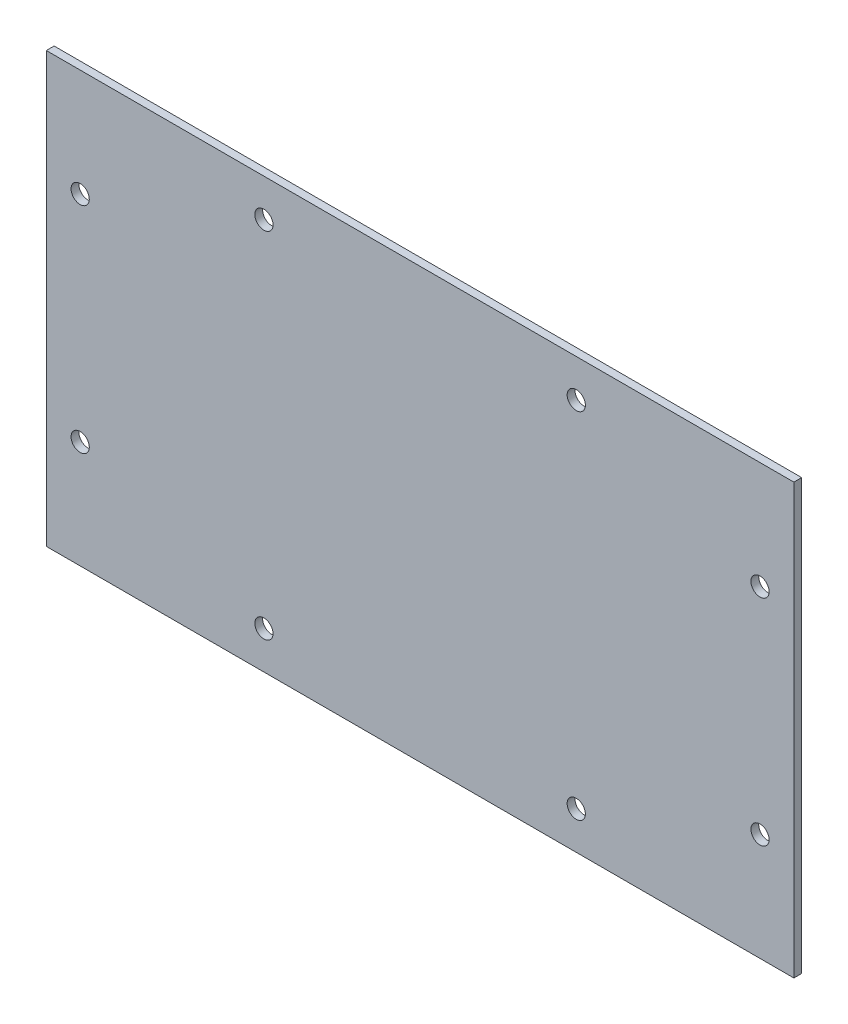
ISO-10303-21;
HEADER;
FILE_DESCRIPTION(('STEP AP214'),'2;1');
FILE_NAME('part.step','',(''),(''),'','','');
FILE_SCHEMA(('AUTOMOTIVE_DESIGN { 1 0 10303 214 1 1 1 1 }'));
ENDSEC;
DATA;
#1=APPLICATION_CONTEXT('core data for automotive mechanical design processes');
#2=APPLICATION_PROTOCOL_DEFINITION('international standard','automotive_design',2000,#1);
#3=PRODUCT_CONTEXT('',#1,'mechanical');
#4=PRODUCT('Part','Part','',(#3));
#5=PRODUCT_RELATED_PRODUCT_CATEGORY('part','',(#4));
#6=PRODUCT_DEFINITION_FORMATION('','',#4);
#7=PRODUCT_DEFINITION_CONTEXT('part definition',#1,'design');
#8=PRODUCT_DEFINITION('design','',#6,#7);
#9=PRODUCT_DEFINITION_SHAPE('','',#8);
#10=(LENGTH_UNIT() NAMED_UNIT(*) SI_UNIT(.MILLI.,.METRE.));
#11=(NAMED_UNIT(*) PLANE_ANGLE_UNIT() SI_UNIT($,.RADIAN.));
#12=(NAMED_UNIT(*) SI_UNIT($,.STERADIAN.) SOLID_ANGLE_UNIT());
#13=UNCERTAINTY_MEASURE_WITH_UNIT(LENGTH_MEASURE(1.E-05),#10,'distance_accuracy_value','');
#14=(GEOMETRIC_REPRESENTATION_CONTEXT(3) GLOBAL_UNCERTAINTY_ASSIGNED_CONTEXT((#13)) GLOBAL_UNIT_ASSIGNED_CONTEXT((#10,
#11,#12)) REPRESENTATION_CONTEXT('',''));
#15=CARTESIAN_POINT('',(0.,0.,0.));
#16=DIRECTION('',(0.,0.,1.));
#17=DIRECTION('',(1.,0.,0.));
#18=AXIS2_PLACEMENT_3D('',#15,#16,#17);
#19=CARTESIAN_POINT('',(0.,0.,3.));
#20=DIRECTION('',(0.,0.,1.));
#21=DIRECTION('',(1.,0.,0.));
#22=AXIS2_PLACEMENT_3D('',#19,#20,#21);
#23=PLANE('',#22);
#24=CARTESIAN_POINT('',(-60.,-68.,3.));
#25=DIRECTION('',(0.,0.,1.));
#26=DIRECTION('',(-1.,0.,0.));
#27=AXIS2_PLACEMENT_3D('',#24,#25,#26);
#28=CIRCLE('',#27,3.5);
#29=CARTESIAN_POINT('',(-63.5,-68.,3.));
#30=VERTEX_POINT('',#29);
#31=EDGE_CURVE('E154',#30,#30,#28,.T.);
#32=ORIENTED_EDGE('',*,*,#31,.F.);
#33=EDGE_LOOP('',(#32));
#34=FACE_BOUND('',#33,.T.);
#35=CARTESIAN_POINT('',(60.,-68.,3.));
#36=DIRECTION('',(0.,0.,1.));
#37=DIRECTION('',(1.,0.,0.));
#38=AXIS2_PLACEMENT_3D('',#35,#36,#37);
#39=CIRCLE('',#38,3.50000000000001);
#40=CARTESIAN_POINT('',(63.5,-68.,3.));
#41=VERTEX_POINT('',#40);
#42=EDGE_CURVE('E161',#41,#41,#39,.T.);
#43=ORIENTED_EDGE('',*,*,#42,.F.);
#44=EDGE_LOOP('',(#43));
#45=FACE_BOUND('',#44,.T.);
#46=CARTESIAN_POINT('',(60.,68.,3.));
#47=DIRECTION('',(0.,0.,1.));
#48=DIRECTION('',(-1.,0.,0.));
#49=AXIS2_PLACEMENT_3D('',#46,#47,#48);
#50=CIRCLE('',#49,3.50000000000001);
#51=CARTESIAN_POINT('',(56.5,68.,3.));
#52=VERTEX_POINT('',#51);
#53=EDGE_CURVE('E149',#52,#52,#50,.T.);
#54=ORIENTED_EDGE('',*,*,#53,.F.);
#55=EDGE_LOOP('',(#54));
#56=FACE_BOUND('',#55,.T.);
#57=CARTESIAN_POINT('',(-60.,68.,3.));
#58=DIRECTION('',(0.,0.,1.));
#59=DIRECTION('',(1.,0.,0.));
#60=AXIS2_PLACEMENT_3D('',#57,#58,#59);
#61=CIRCLE('',#60,3.5);
#62=CARTESIAN_POINT('',(-56.5,68.,3.));
#63=VERTEX_POINT('',#62);
#64=EDGE_CURVE('E148',#63,#63,#61,.T.);
#65=ORIENTED_EDGE('',*,*,#64,.F.);
#66=EDGE_LOOP('',(#65));
#67=FACE_BOUND('',#66,.T.);
#68=CARTESIAN_POINT('',(130.600000000622,-41.2500000000001,3.));
#69=DIRECTION('',(0.,0.,1.));
#70=DIRECTION('',(1.,0.,0.));
#71=AXIS2_PLACEMENT_3D('',#68,#69,#70);
#72=CIRCLE('',#71,3.49999999999999);
#73=CARTESIAN_POINT('',(134.100000000622,-41.2500000000001,3.));
#74=VERTEX_POINT('',#73);
#75=EDGE_CURVE('E134',#74,#74,#72,.T.);
#76=ORIENTED_EDGE('',*,*,#75,.F.);
#77=EDGE_LOOP('',(#76));
#78=FACE_BOUND('',#77,.T.);
#79=CARTESIAN_POINT('',(-130.600000000622,41.2500000000001,3.));
#80=DIRECTION('',(0.,0.,1.));
#81=DIRECTION('',(1.,0.,0.));
#82=AXIS2_PLACEMENT_3D('',#79,#80,#81);
#83=CIRCLE('',#82,3.49999999999999);
#84=CARTESIAN_POINT('',(-127.100000000622,41.2500000000001,3.));
#85=VERTEX_POINT('',#84);
#86=EDGE_CURVE('E109',#85,#85,#83,.T.);
#87=ORIENTED_EDGE('',*,*,#86,.F.);
#88=EDGE_LOOP('',(#87));
#89=FACE_BOUND('',#88,.T.);
#90=DIRECTION('',(0.,-1.,0.));
#91=VECTOR('',#90,1.);
#92=CARTESIAN_POINT('',(-143.600000000622,82.5,3.));
#93=LINE('',#92,#91);
#94=CARTESIAN_POINT('',(-143.600000000622,82.5,3.));
#95=VERTEX_POINT('',#94);
#96=CARTESIAN_POINT('',(-143.600000000622,-82.5,3.));
#97=VERTEX_POINT('',#96);
#98=EDGE_CURVE('E92',#95,#97,#93,.T.);
#99=ORIENTED_EDGE('',*,*,#98,.T.);
#100=DIRECTION('',(1.,0.,0.));
#101=VECTOR('',#100,1.);
#102=CARTESIAN_POINT('',(-143.600000000622,-82.5,3.));
#103=LINE('',#102,#101);
#104=CARTESIAN_POINT('',(143.600000000622,-82.5000000000001,3.));
#105=VERTEX_POINT('',#104);
#106=EDGE_CURVE('E89',#97,#105,#103,.T.);
#107=ORIENTED_EDGE('',*,*,#106,.T.);
#108=DIRECTION('',(0.,1.,0.));
#109=VECTOR('',#108,1.);
#110=CARTESIAN_POINT('',(143.600000000622,82.5000000000001,3.));
#111=LINE('',#110,#109);
#112=CARTESIAN_POINT('',(143.600000000622,82.5000000000001,3.));
#113=VERTEX_POINT('',#112);
#114=EDGE_CURVE('E91',#105,#113,#111,.T.);
#115=ORIENTED_EDGE('',*,*,#114,.T.);
#116=DIRECTION('',(-1.,0.,0.));
#117=VECTOR('',#116,1.);
#118=CARTESIAN_POINT('',(-143.600000000622,82.5,3.));
#119=LINE('',#118,#117);
#120=EDGE_CURVE('E58',#113,#95,#119,.T.);
#121=ORIENTED_EDGE('',*,*,#120,.T.);
#122=EDGE_LOOP('',(#99,#107,#115,#121));
#123=FACE_BOUND('',#122,.T.);
#124=CARTESIAN_POINT('',(-130.600000000622,-41.2500000000001,3.));
#125=DIRECTION('',(0.,0.,1.));
#126=DIRECTION('',(-1.,0.,0.));
#127=AXIS2_PLACEMENT_3D('',#124,#125,#126);
#128=CIRCLE('',#127,3.49999999999999);
#129=CARTESIAN_POINT('',(-134.100000000622,-41.2500000000001,3.));
#130=VERTEX_POINT('',#129);
#131=EDGE_CURVE('E124',#130,#130,#128,.T.);
#132=ORIENTED_EDGE('',*,*,#131,.F.);
#133=EDGE_LOOP('',(#132));
#134=FACE_BOUND('',#133,.T.);
#135=CARTESIAN_POINT('',(130.600000000622,41.2500000000001,3.));
#136=DIRECTION('',(0.,0.,1.));
#137=DIRECTION('',(-1.,0.,0.));
#138=AXIS2_PLACEMENT_3D('',#135,#136,#137);
#139=CIRCLE('',#138,3.49999999999999);
#140=CARTESIAN_POINT('',(127.100000000622,41.2500000000001,3.));
#141=VERTEX_POINT('',#140);
#142=EDGE_CURVE('E140',#141,#141,#139,.T.);
#143=ORIENTED_EDGE('',*,*,#142,.F.);
#144=EDGE_LOOP('',(#143));
#145=FACE_BOUND('',#144,.T.);
#146=ADVANCED_FACE('F43',(#34,#45,#56,#67,#78,#89,#123,#134,#145),#23,.T.);
#147=CARTESIAN_POINT('',(0.,0.,0.));
#148=DIRECTION('',(0.,0.,1.));
#149=DIRECTION('',(1.,0.,0.));
#150=AXIS2_PLACEMENT_3D('',#147,#148,#149);
#151=PLANE('',#150);
#152=CARTESIAN_POINT('',(-60.,-68.,0.));
#153=DIRECTION('',(0.,0.,1.));
#154=DIRECTION('',(-1.,0.,0.));
#155=AXIS2_PLACEMENT_3D('',#152,#153,#154);
#156=CIRCLE('',#155,3.5);
#157=CARTESIAN_POINT('',(-63.5,-68.,0.));
#158=VERTEX_POINT('',#157);
#159=EDGE_CURVE('E155',#158,#158,#156,.T.);
#160=ORIENTED_EDGE('',*,*,#159,.T.);
#161=EDGE_LOOP('',(#160));
#162=FACE_BOUND('',#161,.T.);
#163=CARTESIAN_POINT('',(60.,-68.,0.));
#164=DIRECTION('',(0.,0.,1.));
#165=DIRECTION('',(1.,0.,0.));
#166=AXIS2_PLACEMENT_3D('',#163,#164,#165);
#167=CIRCLE('',#166,3.50000000000001);
#168=CARTESIAN_POINT('',(63.5,-68.,0.));
#169=VERTEX_POINT('',#168);
#170=EDGE_CURVE('E158',#169,#169,#167,.T.);
#171=ORIENTED_EDGE('',*,*,#170,.T.);
#172=EDGE_LOOP('',(#171));
#173=FACE_BOUND('',#172,.T.);
#174=CARTESIAN_POINT('',(60.,68.,0.));
#175=DIRECTION('',(0.,0.,1.));
#176=DIRECTION('',(-1.,0.,0.));
#177=AXIS2_PLACEMENT_3D('',#174,#175,#176);
#178=CIRCLE('',#177,3.50000000000001);
#179=CARTESIAN_POINT('',(56.5,68.,0.));
#180=VERTEX_POINT('',#179);
#181=EDGE_CURVE('E163',#180,#180,#178,.T.);
#182=ORIENTED_EDGE('',*,*,#181,.T.);
#183=EDGE_LOOP('',(#182));
#184=FACE_BOUND('',#183,.T.);
#185=CARTESIAN_POINT('',(-60.,68.,0.));
#186=DIRECTION('',(0.,0.,1.));
#187=DIRECTION('',(1.,0.,0.));
#188=AXIS2_PLACEMENT_3D('',#185,#186,#187);
#189=CIRCLE('',#188,3.5);
#190=CARTESIAN_POINT('',(-56.5,68.,0.));
#191=VERTEX_POINT('',#190);
#192=EDGE_CURVE('E141',#191,#191,#189,.T.);
#193=ORIENTED_EDGE('',*,*,#192,.T.);
#194=EDGE_LOOP('',(#193));
#195=FACE_BOUND('',#194,.T.);
#196=DIRECTION('',(0.,-1.,0.));
#197=VECTOR('',#196,1.);
#198=CARTESIAN_POINT('',(-143.600000000622,82.5,0.));
#199=LINE('',#198,#197);
#200=CARTESIAN_POINT('',(-143.600000000622,82.5,0.));
#201=VERTEX_POINT('',#200);
#202=CARTESIAN_POINT('',(-143.600000000622,-82.5,0.));
#203=VERTEX_POINT('',#202);
#204=EDGE_CURVE('E110',#201,#203,#199,.T.);
#205=ORIENTED_EDGE('',*,*,#204,.F.);
#206=DIRECTION('',(-1.,0.,0.));
#207=VECTOR('',#206,1.);
#208=CARTESIAN_POINT('',(-143.600000000622,82.5,0.));
#209=LINE('',#208,#207);
#210=CARTESIAN_POINT('',(143.600000000622,82.5000000000001,0.));
#211=VERTEX_POINT('',#210);
#212=EDGE_CURVE('E83',#211,#201,#209,.T.);
#213=ORIENTED_EDGE('',*,*,#212,.F.);
#214=DIRECTION('',(0.,1.,0.));
#215=VECTOR('',#214,1.);
#216=CARTESIAN_POINT('',(143.600000000622,82.5000000000001,0.));
#217=LINE('',#216,#215);
#218=CARTESIAN_POINT('',(143.600000000622,-82.5000000000001,0.));
#219=VERTEX_POINT('',#218);
#220=EDGE_CURVE('E76',#219,#211,#217,.T.);
#221=ORIENTED_EDGE('',*,*,#220,.F.);
#222=DIRECTION('',(1.,0.,0.));
#223=VECTOR('',#222,1.);
#224=CARTESIAN_POINT('',(-143.600000000622,-82.5,0.));
#225=LINE('',#224,#223);
#226=EDGE_CURVE('E97',#203,#219,#225,.T.);
#227=ORIENTED_EDGE('',*,*,#226,.F.);
#228=EDGE_LOOP('',(#205,#213,#221,#227));
#229=FACE_BOUND('',#228,.T.);
#230=CARTESIAN_POINT('',(-130.600000000622,41.2500000000001,0.));
#231=DIRECTION('',(0.,0.,1.));
#232=DIRECTION('',(1.,0.,0.));
#233=AXIS2_PLACEMENT_3D('',#230,#231,#232);
#234=CIRCLE('',#233,3.49999999999999);
#235=CARTESIAN_POINT('',(-127.100000000622,41.2500000000001,0.));
#236=VERTEX_POINT('',#235);
#237=EDGE_CURVE('E125',#236,#236,#234,.T.);
#238=ORIENTED_EDGE('',*,*,#237,.T.);
#239=EDGE_LOOP('',(#238));
#240=FACE_BOUND('',#239,.T.);
#241=CARTESIAN_POINT('',(-130.600000000622,-41.2500000000001,0.));
#242=DIRECTION('',(0.,0.,1.));
#243=DIRECTION('',(-1.,0.,0.));
#244=AXIS2_PLACEMENT_3D('',#241,#242,#243);
#245=CIRCLE('',#244,3.49999999999999);
#246=CARTESIAN_POINT('',(-134.100000000622,-41.2500000000001,0.));
#247=VERTEX_POINT('',#246);
#248=EDGE_CURVE('E126',#247,#247,#245,.T.);
#249=ORIENTED_EDGE('',*,*,#248,.T.);
#250=EDGE_LOOP('',(#249));
#251=FACE_BOUND('',#250,.T.);
#252=CARTESIAN_POINT('',(130.600000000622,-41.2500000000001,0.));
#253=DIRECTION('',(0.,0.,1.));
#254=DIRECTION('',(1.,0.,0.));
#255=AXIS2_PLACEMENT_3D('',#252,#253,#254);
#256=CIRCLE('',#255,3.49999999999999);
#257=CARTESIAN_POINT('',(134.100000000622,-41.2500000000001,0.));
#258=VERTEX_POINT('',#257);
#259=EDGE_CURVE('E133',#258,#258,#256,.T.);
#260=ORIENTED_EDGE('',*,*,#259,.T.);
#261=EDGE_LOOP('',(#260));
#262=FACE_BOUND('',#261,.T.);
#263=CARTESIAN_POINT('',(130.600000000622,41.2500000000001,0.));
#264=DIRECTION('',(0.,0.,1.));
#265=DIRECTION('',(-1.,0.,0.));
#266=AXIS2_PLACEMENT_3D('',#263,#264,#265);
#267=CIRCLE('',#266,3.49999999999999);
#268=CARTESIAN_POINT('',(127.100000000622,41.2500000000001,0.));
#269=VERTEX_POINT('',#268);
#270=EDGE_CURVE('E139',#269,#269,#267,.T.);
#271=ORIENTED_EDGE('',*,*,#270,.T.);
#272=EDGE_LOOP('',(#271));
#273=FACE_BOUND('',#272,.T.);
#274=ADVANCED_FACE('F120',(#162,#173,#184,#195,#229,#240,#251,#262,#273),#151,.F.);
#275=CARTESIAN_POINT('',(-143.600000000622,82.5,3.));
#276=DIRECTION('',(1.,0.,0.));
#277=DIRECTION('',(0.,0.,-1.));
#278=AXIS2_PLACEMENT_3D('',#275,#276,#277);
#279=PLANE('',#278);
#280=ORIENTED_EDGE('',*,*,#204,.T.);
#281=DIRECTION('',(0.,0.,-1.));
#282=VECTOR('',#281,1.);
#283=CARTESIAN_POINT('',(-143.600000000622,-82.5,3.));
#284=LINE('',#283,#282);
#285=EDGE_CURVE('E11',#97,#203,#284,.T.);
#286=ORIENTED_EDGE('',*,*,#285,.F.);
#287=ORIENTED_EDGE('',*,*,#98,.F.);
#288=DIRECTION('',(0.,0.,-1.));
#289=VECTOR('',#288,1.);
#290=CARTESIAN_POINT('',(-143.600000000622,82.5,3.));
#291=LINE('',#290,#289);
#292=EDGE_CURVE('E103',#95,#201,#291,.T.);
#293=ORIENTED_EDGE('',*,*,#292,.T.);
#294=EDGE_LOOP('',(#280,#286,#287,#293));
#295=FACE_BOUND('',#294,.T.);
#296=ADVANCED_FACE('F44',(#295),#279,.F.);
#297=CARTESIAN_POINT('',(-143.600000000622,-82.5,3.));
#298=DIRECTION('',(0.,1.,0.));
#299=DIRECTION('',(-1.,0.,0.));
#300=AXIS2_PLACEMENT_3D('',#297,#298,#299);
#301=PLANE('',#300);
#302=ORIENTED_EDGE('',*,*,#226,.T.);
#303=DIRECTION('',(0.,0.,-1.));
#304=VECTOR('',#303,1.);
#305=CARTESIAN_POINT('',(143.600000000622,-82.5000000000001,3.));
#306=LINE('',#305,#304);
#307=EDGE_CURVE('E55',#105,#219,#306,.T.);
#308=ORIENTED_EDGE('',*,*,#307,.F.);
#309=ORIENTED_EDGE('',*,*,#106,.F.);
#310=ORIENTED_EDGE('',*,*,#285,.T.);
#311=EDGE_LOOP('',(#302,#308,#309,#310));
#312=FACE_BOUND('',#311,.T.);
#313=ADVANCED_FACE('F98',(#312),#301,.F.);
#314=CARTESIAN_POINT('',(143.600000000622,82.5000000000001,3.));
#315=DIRECTION('',(-1.,0.,0.));
#316=DIRECTION('',(0.,0.,1.));
#317=AXIS2_PLACEMENT_3D('',#314,#315,#316);
#318=PLANE('',#317);
#319=ORIENTED_EDGE('',*,*,#220,.T.);
#320=DIRECTION('',(0.,0.,-1.));
#321=VECTOR('',#320,1.);
#322=CARTESIAN_POINT('',(143.600000000622,82.5000000000001,3.));
#323=LINE('',#322,#321);
#324=EDGE_CURVE('E99',#113,#211,#323,.T.);
#325=ORIENTED_EDGE('',*,*,#324,.F.);
#326=ORIENTED_EDGE('',*,*,#114,.F.);
#327=ORIENTED_EDGE('',*,*,#307,.T.);
#328=EDGE_LOOP('',(#319,#325,#326,#327));
#329=FACE_BOUND('',#328,.T.);
#330=ADVANCED_FACE('F101',(#329),#318,.F.);
#331=CARTESIAN_POINT('',(-143.600000000622,82.5,3.));
#332=DIRECTION('',(0.,-1.,0.));
#333=DIRECTION('',(1.,0.,0.));
#334=AXIS2_PLACEMENT_3D('',#331,#332,#333);
#335=PLANE('',#334);
#336=ORIENTED_EDGE('',*,*,#212,.T.);
#337=ORIENTED_EDGE('',*,*,#292,.F.);
#338=ORIENTED_EDGE('',*,*,#120,.F.);
#339=ORIENTED_EDGE('',*,*,#324,.T.);
#340=EDGE_LOOP('',(#336,#337,#338,#339));
#341=FACE_BOUND('',#340,.T.);
#342=ADVANCED_FACE('F113',(#341),#335,.F.);
#343=CARTESIAN_POINT('',(-130.600000000622,41.2500000000001,3.));
#344=DIRECTION('',(0.,0.,-1.));
#345=DIRECTION('',(-1.,0.,0.));
#346=AXIS2_PLACEMENT_3D('',#343,#344,#345);
#347=CYLINDRICAL_SURFACE('',#346,3.49999999999999);
#348=ORIENTED_EDGE('',*,*,#86,.T.);
#349=EDGE_LOOP('',(#348));
#350=FACE_BOUND('',#349,.T.);
#351=ORIENTED_EDGE('',*,*,#237,.F.);
#352=EDGE_LOOP('',(#351));
#353=FACE_BOUND('',#352,.T.);
#354=ADVANCED_FACE('F185',(#350,#353),#347,.F.);
#355=CARTESIAN_POINT('',(-130.600000000622,-41.2500000000001,3.));
#356=DIRECTION('',(0.,0.,-1.));
#357=DIRECTION('',(-1.,0.,0.));
#358=AXIS2_PLACEMENT_3D('',#355,#356,#357);
#359=CYLINDRICAL_SURFACE('',#358,3.49999999999999);
#360=ORIENTED_EDGE('',*,*,#131,.T.);
#361=EDGE_LOOP('',(#360));
#362=FACE_BOUND('',#361,.T.);
#363=ORIENTED_EDGE('',*,*,#248,.F.);
#364=EDGE_LOOP('',(#363));
#365=FACE_BOUND('',#364,.T.);
#366=ADVANCED_FACE('F183',(#362,#365),#359,.F.);
#367=CARTESIAN_POINT('',(130.600000000622,-41.2500000000001,3.));
#368=DIRECTION('',(0.,0.,-1.));
#369=DIRECTION('',(-1.,0.,0.));
#370=AXIS2_PLACEMENT_3D('',#367,#368,#369);
#371=CYLINDRICAL_SURFACE('',#370,3.49999999999999);
#372=ORIENTED_EDGE('',*,*,#75,.T.);
#373=EDGE_LOOP('',(#372));
#374=FACE_BOUND('',#373,.T.);
#375=ORIENTED_EDGE('',*,*,#259,.F.);
#376=EDGE_LOOP('',(#375));
#377=FACE_BOUND('',#376,.T.);
#378=ADVANCED_FACE('F203',(#374,#377),#371,.F.);
#379=CARTESIAN_POINT('',(130.600000000622,41.2500000000001,3.));
#380=DIRECTION('',(0.,0.,-1.));
#381=DIRECTION('',(-1.,0.,0.));
#382=AXIS2_PLACEMENT_3D('',#379,#380,#381);
#383=CYLINDRICAL_SURFACE('',#382,3.49999999999999);
#384=ORIENTED_EDGE('',*,*,#142,.T.);
#385=EDGE_LOOP('',(#384));
#386=FACE_BOUND('',#385,.T.);
#387=ORIENTED_EDGE('',*,*,#270,.F.);
#388=EDGE_LOOP('',(#387));
#389=FACE_BOUND('',#388,.T.);
#390=ADVANCED_FACE('F196',(#386,#389),#383,.F.);
#391=CARTESIAN_POINT('',(-60.,68.,0.));
#392=DIRECTION('',(0.,0.,1.));
#393=DIRECTION('',(1.,0.,0.));
#394=AXIS2_PLACEMENT_3D('',#391,#392,#393);
#395=CYLINDRICAL_SURFACE('',#394,3.5);
#396=ORIENTED_EDGE('',*,*,#192,.F.);
#397=EDGE_LOOP('',(#396));
#398=FACE_BOUND('',#397,.T.);
#399=ORIENTED_EDGE('',*,*,#64,.T.);
#400=EDGE_LOOP('',(#399));
#401=FACE_BOUND('',#400,.T.);
#402=ADVANCED_FACE('F199',(#398,#401),#395,.F.);
#403=CARTESIAN_POINT('',(60.,68.,0.));
#404=DIRECTION('',(0.,0.,1.));
#405=DIRECTION('',(1.,0.,0.));
#406=AXIS2_PLACEMENT_3D('',#403,#404,#405);
#407=CYLINDRICAL_SURFACE('',#406,3.50000000000001);
#408=ORIENTED_EDGE('',*,*,#181,.F.);
#409=EDGE_LOOP('',(#408));
#410=FACE_BOUND('',#409,.T.);
#411=ORIENTED_EDGE('',*,*,#53,.T.);
#412=EDGE_LOOP('',(#411));
#413=FACE_BOUND('',#412,.T.);
#414=ADVANCED_FACE('F168',(#410,#413),#407,.F.);
#415=CARTESIAN_POINT('',(60.,-68.,0.));
#416=DIRECTION('',(0.,0.,1.));
#417=DIRECTION('',(1.,0.,0.));
#418=AXIS2_PLACEMENT_3D('',#415,#416,#417);
#419=CYLINDRICAL_SURFACE('',#418,3.50000000000001);
#420=ORIENTED_EDGE('',*,*,#170,.F.);
#421=EDGE_LOOP('',(#420));
#422=FACE_BOUND('',#421,.T.);
#423=ORIENTED_EDGE('',*,*,#42,.T.);
#424=EDGE_LOOP('',(#423));
#425=FACE_BOUND('',#424,.T.);
#426=ADVANCED_FACE('F282',(#422,#425),#419,.F.);
#427=CARTESIAN_POINT('',(-60.,-68.,0.));
#428=DIRECTION('',(0.,0.,1.));
#429=DIRECTION('',(1.,0.,0.));
#430=AXIS2_PLACEMENT_3D('',#427,#428,#429);
#431=CYLINDRICAL_SURFACE('',#430,3.5);
#432=ORIENTED_EDGE('',*,*,#159,.F.);
#433=EDGE_LOOP('',(#432));
#434=FACE_BOUND('',#433,.T.);
#435=ORIENTED_EDGE('',*,*,#31,.T.);
#436=EDGE_LOOP('',(#435));
#437=FACE_BOUND('',#436,.T.);
#438=ADVANCED_FACE('F293',(#434,#437),#431,.F.);
#439=CLOSED_SHELL('',(#146,#274,#296,#313,#330,#342,#354,#366,#378,#390,#402,#414,#426,#438));
#440=MANIFOLD_SOLID_BREP('B2',#439);
#441=ADVANCED_BREP_SHAPE_REPRESENTATION('',(#18,#440),#14);
#442=SHAPE_DEFINITION_REPRESENTATION(#9,#441);
ENDSEC;
END-ISO-10303-21;
